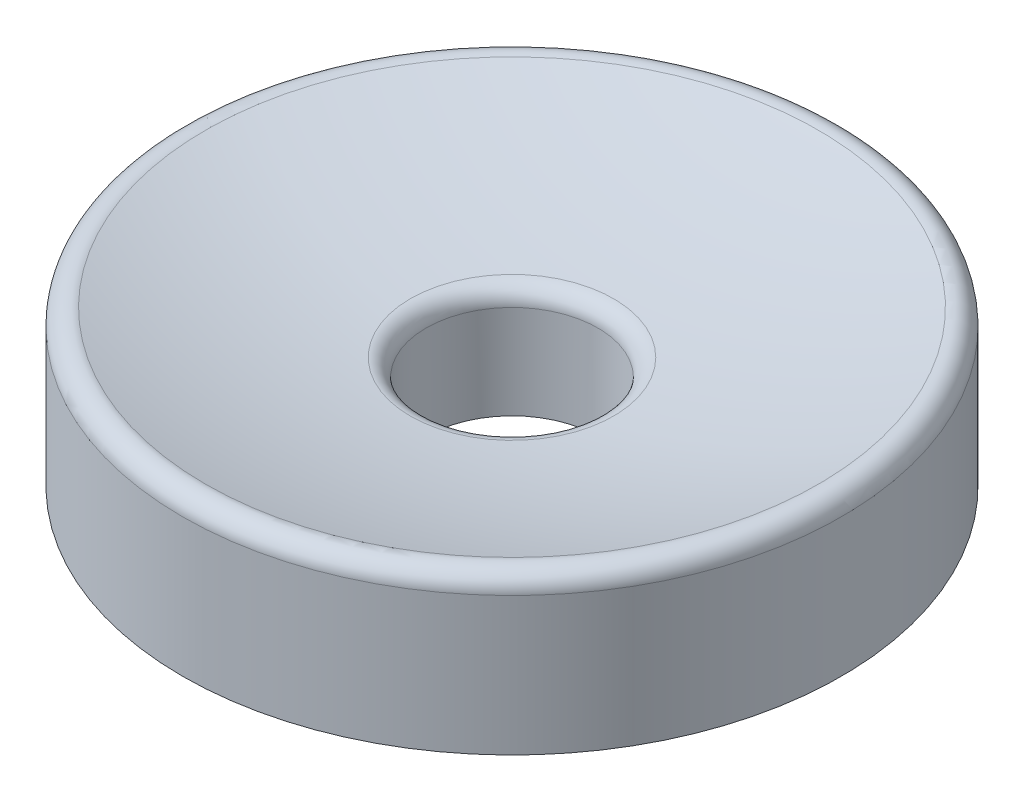
ISO-10303-21;
HEADER;
FILE_DESCRIPTION(('STEP AP214'),'2;1');
FILE_NAME('part.step','',(''),(''),'','','');
FILE_SCHEMA(('AUTOMOTIVE_DESIGN { 1 0 10303 214 1 1 1 1 }'));
ENDSEC;
DATA;
#1=APPLICATION_CONTEXT('core data for automotive mechanical design processes');
#2=APPLICATION_PROTOCOL_DEFINITION('international standard','automotive_design',2000,#1);
#3=PRODUCT_CONTEXT('',#1,'mechanical');
#4=PRODUCT('Part','Part','',(#3));
#5=PRODUCT_RELATED_PRODUCT_CATEGORY('part','',(#4));
#6=PRODUCT_DEFINITION_FORMATION('','',#4);
#7=PRODUCT_DEFINITION_CONTEXT('part definition',#1,'design');
#8=PRODUCT_DEFINITION('design','',#6,#7);
#9=PRODUCT_DEFINITION_SHAPE('','',#8);
#10=(LENGTH_UNIT() NAMED_UNIT(*) SI_UNIT(.MILLI.,.METRE.));
#11=(NAMED_UNIT(*) PLANE_ANGLE_UNIT() SI_UNIT($,.RADIAN.));
#12=(NAMED_UNIT(*) SI_UNIT($,.STERADIAN.) SOLID_ANGLE_UNIT());
#13=UNCERTAINTY_MEASURE_WITH_UNIT(LENGTH_MEASURE(1.E-05),#10,'distance_accuracy_value','');
#14=(GEOMETRIC_REPRESENTATION_CONTEXT(3) GLOBAL_UNCERTAINTY_ASSIGNED_CONTEXT((#13)) GLOBAL_UNIT_ASSIGNED_CONTEXT((#10,
#11,#12)) REPRESENTATION_CONTEXT('',''));
#15=CARTESIAN_POINT('',(0.,0.,0.));
#16=DIRECTION('',(0.,0.,1.));
#17=DIRECTION('',(1.,0.,0.));
#18=AXIS2_PLACEMENT_3D('',#15,#16,#17);
#19=CARTESIAN_POINT('',(0.,0.,0.));
#20=DIRECTION('',(0.,1.,0.));
#21=DIRECTION('',(0.,0.,1.));
#22=AXIS2_PLACEMENT_3D('',#19,#20,#21);
#23=CYLINDRICAL_SURFACE('',#22,19.05);
#24=CARTESIAN_POINT('',(0.,-55.2997142849762,0.));
#25=DIRECTION('',(0.,1.,0.));
#26=DIRECTION('',(0.,0.,1.));
#27=AXIS2_PLACEMENT_3D('',#24,#25,#26);
#28=CIRCLE('',#27,19.05);
#29=CARTESIAN_POINT('',(0.,-55.2997142849762,19.05));
#30=VERTEX_POINT('',#29);
#31=EDGE_CURVE('E63',#30,#30,#28,.F.);
#32=ORIENTED_EDGE('',*,*,#31,.T.);
#33=EDGE_LOOP('',(#32));
#34=FACE_BOUND('',#33,.T.);
#35=CARTESIAN_POINT('',(0.,-63.2838592009184,0.));
#36=DIRECTION('',(0.,1.,0.));
#37=DIRECTION('',(0.,0.,1.));
#38=AXIS2_PLACEMENT_3D('',#35,#36,#37);
#39=CIRCLE('',#38,19.05);
#40=CARTESIAN_POINT('',(0.,-63.2838592009184,19.05));
#41=VERTEX_POINT('',#40);
#42=EDGE_CURVE('E75',#41,#41,#39,.T.);
#43=ORIENTED_EDGE('',*,*,#42,.T.);
#44=EDGE_LOOP('',(#43));
#45=FACE_BOUND('',#44,.T.);
#46=ADVANCED_FACE('F52',(#34,#45),#23,.T.);
#47=CARTESIAN_POINT('',(0.,0.,0.));
#48=DIRECTION('',(0.,1.,0.));
#49=DIRECTION('',(1.,0.,0.));
#50=AXIS2_PLACEMENT_3D('',#47,#48,#49);
#51=SPHERICAL_SURFACE('',#50,57.15);
#52=CARTESIAN_POINT('',(0.,-56.8469949095067,0.));
#53=DIRECTION('',(0.,1.,0.));
#54=DIRECTION('',(-1.,0.,0.));
#55=AXIS2_PLACEMENT_3D('',#52,#53,#54);
#56=CIRCLE('',#55,5.87721615720525);
#57=CARTESIAN_POINT('',(-5.87721615720525,-56.8469949095067,0.));
#58=VERTEX_POINT('',#57);
#59=EDGE_CURVE('E11',#58,#58,#56,.F.);
#60=ORIENTED_EDGE('',*,*,#59,.T.);
#61=EDGE_LOOP('',(#60));
#62=FACE_BOUND('',#61,.T.);
#63=CARTESIAN_POINT('',(0.,-54.3337804110028,0.));
#64=DIRECTION('',(0.,1.,0.));
#65=DIRECTION('',(0.,0.,1.));
#66=AXIS2_PLACEMENT_3D('',#63,#64,#65);
#67=CIRCLE('',#66,17.7189956331878);
#68=CARTESIAN_POINT('',(0.,-54.3337804110028,17.7189956331878));
#69=VERTEX_POINT('',#68);
#70=EDGE_CURVE('E67',#69,#69,#67,.T.);
#71=ORIENTED_EDGE('',*,*,#70,.T.);
#72=EDGE_LOOP('',(#71));
#73=FACE_BOUND('',#72,.T.);
#74=ADVANCED_FACE('F89',(#62,#73),#51,.F.);
#75=CARTESIAN_POINT('',(0.,0.,0.));
#76=DIRECTION('',(0.,1.,0.));
#77=DIRECTION('',(0.,0.,1.));
#78=AXIS2_PLACEMENT_3D('',#75,#76,#77);
#79=CYLINDRICAL_SURFACE('',#78,4.96570000000001);
#80=CARTESIAN_POINT('',(0.,-57.8576081523424,0.));
#81=DIRECTION('',(0.,1.,0.));
#82=DIRECTION('',(-1.,0.,0.));
#83=AXIS2_PLACEMENT_3D('',#80,#81,#82);
#84=CIRCLE('',#83,4.96570000000001);
#85=CARTESIAN_POINT('',(-4.96570000000001,-57.8576081523424,0.));
#86=VERTEX_POINT('',#85);
#87=EDGE_CURVE('E59',#86,#86,#84,.T.);
#88=ORIENTED_EDGE('',*,*,#87,.T.);
#89=EDGE_LOOP('',(#88));
#90=FACE_BOUND('',#89,.T.);
#91=CARTESIAN_POINT('',(0.,-63.2838592009184,0.));
#92=DIRECTION('',(0.,1.,0.));
#93=DIRECTION('',(0.,0.,1.));
#94=AXIS2_PLACEMENT_3D('',#91,#92,#93);
#95=CIRCLE('',#94,4.96570000000001);
#96=CARTESIAN_POINT('',(0.,-63.2838592009184,4.96570000000001));
#97=VERTEX_POINT('',#96);
#98=EDGE_CURVE('E72',#97,#97,#95,.T.);
#99=ORIENTED_EDGE('',*,*,#98,.F.);
#100=EDGE_LOOP('',(#99));
#101=FACE_BOUND('',#100,.T.);
#102=ADVANCED_FACE('F84',(#90,#101),#79,.F.);
#103=CARTESIAN_POINT('',(4.96570000000001,-63.2838592009184,0.));
#104=DIRECTION('',(0.,1.,0.));
#105=DIRECTION('',(0.,0.,1.));
#106=AXIS2_PLACEMENT_3D('',#103,#104,#105);
#107=PLANE('',#106);
#108=ORIENTED_EDGE('',*,*,#42,.F.);
#109=EDGE_LOOP('',(#108));
#110=FACE_BOUND('',#109,.T.);
#111=ORIENTED_EDGE('',*,*,#98,.T.);
#112=EDGE_LOOP('',(#111));
#113=FACE_BOUND('',#112,.T.);
#114=ADVANCED_FACE('F80',(#110,#113),#107,.F.);
#115=CARTESIAN_POINT('',(0.,-55.2997142849762,0.));
#116=DIRECTION('',(0.,1.,0.));
#117=DIRECTION('',(0.,0.,1.));
#118=AXIS2_PLACEMENT_3D('',#115,#116,#117);
#119=TOROIDAL_SURFACE('',#118,18.034,1.016);
#120=ORIENTED_EDGE('',*,*,#31,.F.);
#121=EDGE_LOOP('',(#120));
#122=FACE_BOUND('',#121,.T.);
#123=ORIENTED_EDGE('',*,*,#70,.F.);
#124=EDGE_LOOP('',(#123));
#125=FACE_BOUND('',#124,.T.);
#126=ADVANCED_FACE('F83',(#122,#125),#119,.T.);
#127=CARTESIAN_POINT('',(0.,-57.8576081523424,0.));
#128=DIRECTION('',(0.,1.,0.));
#129=DIRECTION('',(-1.,0.,0.));
#130=AXIS2_PLACEMENT_3D('',#127,#128,#129);
#131=TOROIDAL_SURFACE('',#130,5.98170000000001,1.016);
#132=ORIENTED_EDGE('',*,*,#59,.F.);
#133=EDGE_LOOP('',(#132));
#134=FACE_BOUND('',#133,.T.);
#135=ORIENTED_EDGE('',*,*,#87,.F.);
#136=EDGE_LOOP('',(#135));
#137=FACE_BOUND('',#136,.T.);
#138=ADVANCED_FACE('F54',(#134,#137),#131,.T.);
#139=CLOSED_SHELL('',(#46,#74,#102,#114,#126,#138));
#140=MANIFOLD_SOLID_BREP('B2',#139);
#141=ADVANCED_BREP_SHAPE_REPRESENTATION('',(#18,#140),#14);
#142=SHAPE_DEFINITION_REPRESENTATION(#9,#141);
ENDSEC;
END-ISO-10303-21;
